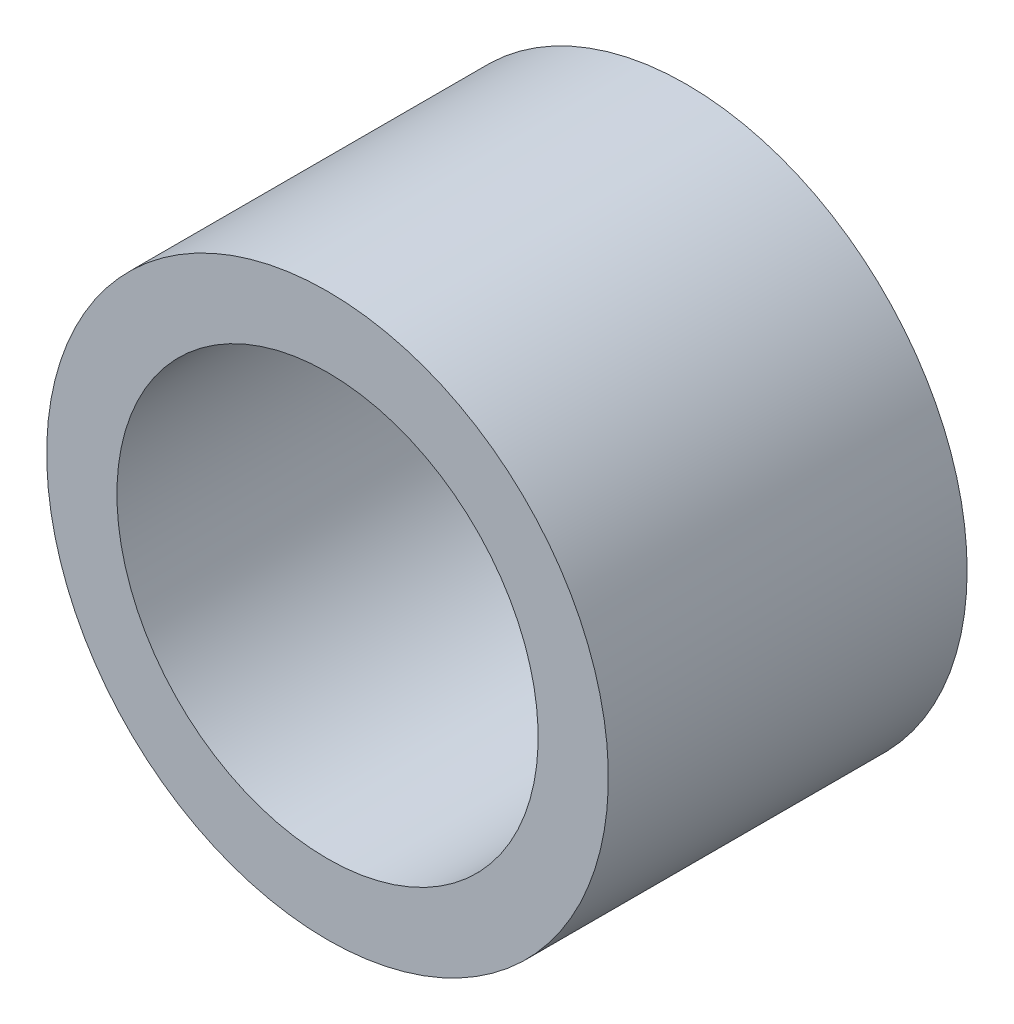
ISO-10303-21;
HEADER;
FILE_DESCRIPTION(('STEP AP214'),'2;1');
FILE_NAME('part.step','',(''),(''),'','','');
FILE_SCHEMA(('AUTOMOTIVE_DESIGN { 1 0 10303 214 1 1 1 1 }'));
ENDSEC;
DATA;
#1=APPLICATION_CONTEXT('core data for automotive mechanical design processes');
#2=APPLICATION_PROTOCOL_DEFINITION('international standard','automotive_design',2000,#1);
#3=PRODUCT_CONTEXT('',#1,'mechanical');
#4=PRODUCT('Part','Part','',(#3));
#5=PRODUCT_RELATED_PRODUCT_CATEGORY('part','',(#4));
#6=PRODUCT_DEFINITION_FORMATION('','',#4);
#7=PRODUCT_DEFINITION_CONTEXT('part definition',#1,'design');
#8=PRODUCT_DEFINITION('design','',#6,#7);
#9=PRODUCT_DEFINITION_SHAPE('','',#8);
#10=(LENGTH_UNIT() NAMED_UNIT(*) SI_UNIT(.MILLI.,.METRE.));
#11=(NAMED_UNIT(*) PLANE_ANGLE_UNIT() SI_UNIT($,.RADIAN.));
#12=(NAMED_UNIT(*) SI_UNIT($,.STERADIAN.) SOLID_ANGLE_UNIT());
#13=UNCERTAINTY_MEASURE_WITH_UNIT(LENGTH_MEASURE(1.E-05),#10,'distance_accuracy_value','');
#14=(GEOMETRIC_REPRESENTATION_CONTEXT(3) GLOBAL_UNCERTAINTY_ASSIGNED_CONTEXT((#13)) GLOBAL_UNIT_ASSIGNED_CONTEXT((#10,
#11,#12)) REPRESENTATION_CONTEXT('',''));
#15=CARTESIAN_POINT('',(0.,0.,0.));
#16=DIRECTION('',(0.,0.,1.));
#17=DIRECTION('',(1.,0.,0.));
#18=AXIS2_PLACEMENT_3D('',#15,#16,#17);
#19=CARTESIAN_POINT('',(0.,0.,0.));
#20=DIRECTION('',(0.,0.,1.));
#21=DIRECTION('',(1.,0.,0.));
#22=AXIS2_PLACEMENT_3D('',#19,#20,#21);
#23=PLANE('',#22);
#24=CARTESIAN_POINT('',(0.,0.,0.));
#25=DIRECTION('',(0.,0.,1.));
#26=DIRECTION('',(1.,0.,0.));
#27=AXIS2_PLACEMENT_3D('',#24,#25,#26);
#28=CIRCLE('',#27,12.7);
#29=CARTESIAN_POINT('',(12.7,0.,0.));
#30=VERTEX_POINT('',#29);
#31=EDGE_CURVE('E39',#30,#30,#28,.T.);
#32=ORIENTED_EDGE('',*,*,#31,.F.);
#33=EDGE_LOOP('',(#32));
#34=FACE_BOUND('',#33,.T.);
#35=CARTESIAN_POINT('',(0.,0.,0.));
#36=DIRECTION('',(0.,0.,1.));
#37=DIRECTION('',(1.,0.,0.));
#38=AXIS2_PLACEMENT_3D('',#35,#36,#37);
#39=CIRCLE('',#38,9.525);
#40=CARTESIAN_POINT('',(9.525,0.,0.));
#41=VERTEX_POINT('',#40);
#42=EDGE_CURVE('E48',#41,#41,#39,.T.);
#43=ORIENTED_EDGE('',*,*,#42,.T.);
#44=EDGE_LOOP('',(#43));
#45=FACE_BOUND('',#44,.T.);
#46=ADVANCED_FACE('F32',(#34,#45),#23,.F.);
#47=CARTESIAN_POINT('',(0.,0.,52.1452744842766));
#48=DIRECTION('',(0.,0.,-1.));
#49=DIRECTION('',(-1.,0.,0.));
#50=AXIS2_PLACEMENT_3D('',#47,#48,#49);
#51=CYLINDRICAL_SURFACE('',#50,12.7);
#52=CARTESIAN_POINT('',(0.,0.,16.22425));
#53=DIRECTION('',(0.,0.,-1.));
#54=DIRECTION('',(0.,1.,0.));
#55=AXIS2_PLACEMENT_3D('',#52,#53,#54);
#56=CIRCLE('',#55,12.7);
#57=CARTESIAN_POINT('',(0.,12.7,16.22425));
#58=VERTEX_POINT('',#57);
#59=EDGE_CURVE('E43',#58,#58,#56,.T.);
#60=ORIENTED_EDGE('',*,*,#59,.T.);
#61=EDGE_LOOP('',(#60));
#62=FACE_BOUND('',#61,.T.);
#63=ORIENTED_EDGE('',*,*,#31,.T.);
#64=EDGE_LOOP('',(#63));
#65=FACE_BOUND('',#64,.T.);
#66=ADVANCED_FACE('F56',(#62,#65),#51,.T.);
#67=CARTESIAN_POINT('',(0.,0.,52.1452744842766));
#68=DIRECTION('',(0.,0.,-1.));
#69=DIRECTION('',(-1.,0.,0.));
#70=AXIS2_PLACEMENT_3D('',#67,#68,#69);
#71=CYLINDRICAL_SURFACE('',#70,9.525);
#72=CARTESIAN_POINT('',(0.,0.,16.22425));
#73=DIRECTION('',(0.,0.,-1.));
#74=DIRECTION('',(0.,1.,0.));
#75=AXIS2_PLACEMENT_3D('',#72,#73,#74);
#76=CIRCLE('',#75,9.525);
#77=CARTESIAN_POINT('',(0.,9.525,16.22425));
#78=VERTEX_POINT('',#77);
#79=EDGE_CURVE('E10',#78,#78,#76,.T.);
#80=ORIENTED_EDGE('',*,*,#79,.F.);
#81=EDGE_LOOP('',(#80));
#82=FACE_BOUND('',#81,.T.);
#83=ORIENTED_EDGE('',*,*,#42,.F.);
#84=EDGE_LOOP('',(#83));
#85=FACE_BOUND('',#84,.T.);
#86=ADVANCED_FACE('F54',(#82,#85),#71,.F.);
#87=CARTESIAN_POINT('',(0.,14.2748,16.22425));
#88=DIRECTION('',(0.,0.,-1.));
#89=DIRECTION('',(-1.,0.,0.));
#90=AXIS2_PLACEMENT_3D('',#87,#88,#89);
#91=PLANE('',#90);
#92=ORIENTED_EDGE('',*,*,#79,.T.);
#93=EDGE_LOOP('',(#92));
#94=FACE_BOUND('',#93,.T.);
#95=ORIENTED_EDGE('',*,*,#59,.F.);
#96=EDGE_LOOP('',(#95));
#97=FACE_BOUND('',#96,.T.);
#98=ADVANCED_FACE('F34',(#94,#97),#91,.F.);
#99=CLOSED_SHELL('',(#46,#66,#86,#98));
#100=MANIFOLD_SOLID_BREP('B2',#99);
#101=ADVANCED_BREP_SHAPE_REPRESENTATION('',(#18,#100),#14);
#102=SHAPE_DEFINITION_REPRESENTATION(#9,#101);
ENDSEC;
END-ISO-10303-21;
